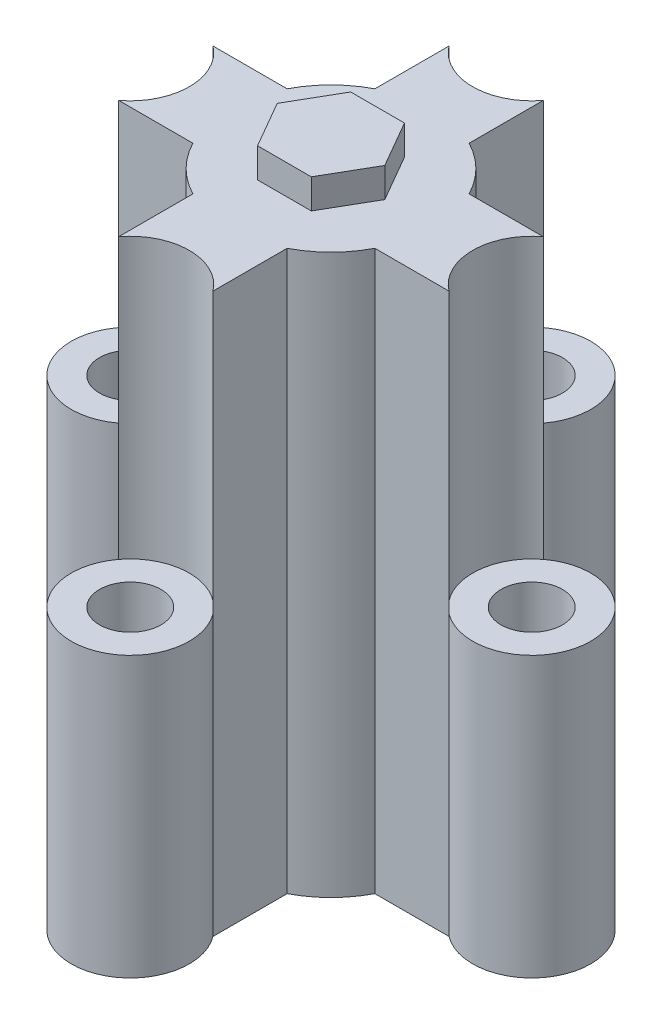
ISO-10303-21;
HEADER;
FILE_DESCRIPTION(('STEP AP214'),'2;1');
FILE_NAME('part.step','',(''),(''),'','','');
FILE_SCHEMA(('AUTOMOTIVE_DESIGN { 1 0 10303 214 1 1 1 1 }'));
ENDSEC;
DATA;
#1=APPLICATION_CONTEXT('core data for automotive mechanical design processes');
#2=APPLICATION_PROTOCOL_DEFINITION('international standard','automotive_design',2000,#1);
#3=PRODUCT_CONTEXT('',#1,'mechanical');
#4=PRODUCT('Part','Part','',(#3));
#5=PRODUCT_RELATED_PRODUCT_CATEGORY('part','',(#4));
#6=PRODUCT_DEFINITION_FORMATION('','',#4);
#7=PRODUCT_DEFINITION_CONTEXT('part definition',#1,'design');
#8=PRODUCT_DEFINITION('design','',#6,#7);
#9=PRODUCT_DEFINITION_SHAPE('','',#8);
#10=(LENGTH_UNIT() NAMED_UNIT(*) SI_UNIT(.MILLI.,.METRE.));
#11=(NAMED_UNIT(*) PLANE_ANGLE_UNIT() SI_UNIT($,.RADIAN.));
#12=(NAMED_UNIT(*) SI_UNIT($,.STERADIAN.) SOLID_ANGLE_UNIT());
#13=UNCERTAINTY_MEASURE_WITH_UNIT(LENGTH_MEASURE(1.E-05),#10,'distance_accuracy_value','');
#14=(GEOMETRIC_REPRESENTATION_CONTEXT(3) GLOBAL_UNCERTAINTY_ASSIGNED_CONTEXT((#13)) GLOBAL_UNIT_ASSIGNED_CONTEXT((#10,
#11,#12)) REPRESENTATION_CONTEXT('',''));
#15=CARTESIAN_POINT('',(0.,0.,0.));
#16=DIRECTION('',(0.,0.,1.));
#17=DIRECTION('',(1.,0.,0.));
#18=AXIS2_PLACEMENT_3D('',#15,#16,#17);
#19=CARTESIAN_POINT('',(0.,60.,-21.548));
#20=DIRECTION('',(0.,-1.,0.));
#21=DIRECTION('',(0.,0.,-1.));
#22=AXIS2_PLACEMENT_3D('',#19,#20,#21);
#23=CYLINDRICAL_SURFACE('',#22,6.33899999999994);
#24=CARTESIAN_POINT('',(0.,30.,-21.548));
#25=DIRECTION('',(0.,1.,0.));
#26=DIRECTION('',(0.,0.,1.));
#27=AXIS2_PLACEMENT_3D('',#24,#25,#26);
#28=CIRCLE('',#27,6.33899999999994);
#29=CARTESIAN_POINT('',(-5.0582994831862,30.,-17.7274598106554));
#30=VERTEX_POINT('',#29);
#31=CARTESIAN_POINT('',(5.05829948318621,30.,-17.7274598106554));
#32=VERTEX_POINT('',#31);
#33=EDGE_CURVE('E258',#30,#32,#28,.T.);
#34=ORIENTED_EDGE('',*,*,#33,.F.);
#35=DIRECTION('',(0.,-1.,0.));
#36=VECTOR('',#35,1.);
#37=CARTESIAN_POINT('',(-5.0582994831862,60.,-17.7274598106554));
#38=LINE('',#37,#36);
#39=CARTESIAN_POINT('',(-5.0582994831862,60.,-17.7274598106554));
#40=VERTEX_POINT('',#39);
#41=EDGE_CURVE('E11',#40,#30,#38,.T.);
#42=ORIENTED_EDGE('',*,*,#41,.F.);
#43=CARTESIAN_POINT('',(0.,60.,-21.548));
#44=DIRECTION('',(0.,1.,0.));
#45=DIRECTION('',(0.,0.,1.));
#46=AXIS2_PLACEMENT_3D('',#43,#44,#45);
#47=CIRCLE('',#46,6.33899999999994);
#48=CARTESIAN_POINT('',(5.05829948318621,60.,-17.7274598106554));
#49=VERTEX_POINT('',#48);
#50=EDGE_CURVE('E342',#40,#49,#47,.T.);
#51=ORIENTED_EDGE('',*,*,#50,.T.);
#52=DIRECTION('',(0.,-1.,0.));
#53=VECTOR('',#52,1.);
#54=CARTESIAN_POINT('',(5.05829948318621,60.,-17.7274598106554));
#55=LINE('',#54,#53);
#56=EDGE_CURVE('E393',#49,#32,#55,.T.);
#57=ORIENTED_EDGE('',*,*,#56,.T.);
#58=EDGE_LOOP('',(#34,#42,#51,#57));
#59=FACE_BOUND('',#58,.T.);
#60=ADVANCED_FACE('F47',(#59),#23,.F.);
#61=CARTESIAN_POINT('',(-5.05829948318621,60.,0.));
#62=DIRECTION('',(1.,0.,0.));
#63=DIRECTION('',(0.,0.,-1.));
#64=AXIS2_PLACEMENT_3D('',#61,#62,#63);
#65=PLANE('',#64);
#66=DIRECTION('',(0.,0.,1.));
#67=VECTOR('',#66,1.);
#68=CARTESIAN_POINT('',(-5.05829948318621,0.,0.));
#69=LINE('',#68,#67);
#70=CARTESIAN_POINT('',(-5.0582994831862,0.,-17.7274598106554));
#71=VERTEX_POINT('',#70);
#72=CARTESIAN_POINT('',(-5.05829948318621,0.,-9.76798885842926));
#73=VERTEX_POINT('',#72);
#74=EDGE_CURVE('E341',#71,#73,#69,.T.);
#75=ORIENTED_EDGE('',*,*,#74,.T.);
#76=DIRECTION('',(0.,-1.,0.));
#77=VECTOR('',#76,1.);
#78=CARTESIAN_POINT('',(-5.05829948318621,60.,-9.76798885842926));
#79=LINE('',#78,#77);
#80=CARTESIAN_POINT('',(-5.05829948318621,60.,-9.76798885842926));
#81=VERTEX_POINT('',#80);
#82=EDGE_CURVE('E55',#81,#73,#79,.T.);
#83=ORIENTED_EDGE('',*,*,#82,.F.);
#84=DIRECTION('',(0.,0.,1.));
#85=VECTOR('',#84,1.);
#86=CARTESIAN_POINT('',(-5.05829948318621,60.,0.));
#87=LINE('',#86,#85);
#88=EDGE_CURVE('E346',#40,#81,#87,.T.);
#89=ORIENTED_EDGE('',*,*,#88,.F.);
#90=ORIENTED_EDGE('',*,*,#41,.T.);
#91=DIRECTION('',(0.,-1.,0.));
#92=VECTOR('',#91,1.);
#93=CARTESIAN_POINT('',(-5.0582994831862,30.,-17.7274598106554));
#94=LINE('',#93,#92);
#95=EDGE_CURVE('E269',#71,#30,#94,.F.);
#96=ORIENTED_EDGE('',*,*,#95,.F.);
#97=EDGE_LOOP('',(#75,#83,#89,#90,#96));
#98=FACE_BOUND('',#97,.T.);
#99=ADVANCED_FACE('F556',(#98),#65,.F.);
#100=CARTESIAN_POINT('',(0.,60.,0.));
#101=DIRECTION('',(0.,-1.,0.));
#102=DIRECTION('',(0.,0.,-1.));
#103=AXIS2_PLACEMENT_3D('',#100,#101,#102);
#104=CYLINDRICAL_SURFACE('',#103,11.);
#105=CARTESIAN_POINT('',(0.,0.,0.));
#106=DIRECTION('',(0.,1.,0.));
#107=DIRECTION('',(0.,0.,1.));
#108=AXIS2_PLACEMENT_3D('',#105,#106,#107);
#109=CIRCLE('',#108,11.);
#110=CARTESIAN_POINT('',(-9.76798885842925,0.,-5.05829948318622));
#111=VERTEX_POINT('',#110);
#112=EDGE_CURVE('E396',#73,#111,#109,.T.);
#113=ORIENTED_EDGE('',*,*,#112,.T.);
#114=DIRECTION('',(0.,-1.,0.));
#115=VECTOR('',#114,1.);
#116=CARTESIAN_POINT('',(-9.76798885842925,60.,-5.05829948318622));
#117=LINE('',#116,#115);
#118=CARTESIAN_POINT('',(-9.76798885842925,60.,-5.05829948318622));
#119=VERTEX_POINT('',#118);
#120=EDGE_CURVE('E475',#119,#111,#117,.T.);
#121=ORIENTED_EDGE('',*,*,#120,.F.);
#122=CARTESIAN_POINT('',(0.,60.,0.));
#123=DIRECTION('',(0.,1.,0.));
#124=DIRECTION('',(0.,0.,1.));
#125=AXIS2_PLACEMENT_3D('',#122,#123,#124);
#126=CIRCLE('',#125,11.);
#127=EDGE_CURVE('E350',#81,#119,#126,.T.);
#128=ORIENTED_EDGE('',*,*,#127,.F.);
#129=ORIENTED_EDGE('',*,*,#82,.T.);
#130=EDGE_LOOP('',(#113,#121,#128,#129));
#131=FACE_BOUND('',#130,.T.);
#132=ADVANCED_FACE('F483',(#131),#104,.T.);
#133=CARTESIAN_POINT('',(0.,60.,-5.05829948318622));
#134=DIRECTION('',(0.,0.,-1.));
#135=DIRECTION('',(-1.,0.,0.));
#136=AXIS2_PLACEMENT_3D('',#133,#134,#135);
#137=PLANE('',#136);
#138=DIRECTION('',(1.,0.,0.));
#139=VECTOR('',#138,1.);
#140=CARTESIAN_POINT('',(0.,0.,-5.05829948318622));
#141=LINE('',#140,#139);
#142=CARTESIAN_POINT('',(-17.7274598106553,0.,-5.05829948318623));
#143=VERTEX_POINT('',#142);
#144=EDGE_CURVE('E400',#143,#111,#141,.T.);
#145=ORIENTED_EDGE('',*,*,#144,.F.);
#146=DIRECTION('',(0.,-1.,0.));
#147=VECTOR('',#146,1.);
#148=CARTESIAN_POINT('',(-17.7274598106553,30.,-5.05829948318623));
#149=LINE('',#148,#147);
#150=CARTESIAN_POINT('',(-17.7274598106553,30.,-5.05829948318623));
#151=VERTEX_POINT('',#150);
#152=EDGE_CURVE('E337',#143,#151,#149,.F.);
#153=ORIENTED_EDGE('',*,*,#152,.T.);
#154=DIRECTION('',(0.,-1.,0.));
#155=VECTOR('',#154,1.);
#156=CARTESIAN_POINT('',(-17.7274598106553,60.,-5.05829948318623));
#157=LINE('',#156,#155);
#158=CARTESIAN_POINT('',(-17.7274598106553,60.,-5.05829948318623));
#159=VERTEX_POINT('',#158);
#160=EDGE_CURVE('E471',#159,#151,#157,.T.);
#161=ORIENTED_EDGE('',*,*,#160,.F.);
#162=DIRECTION('',(1.,0.,0.));
#163=VECTOR('',#162,1.);
#164=CARTESIAN_POINT('',(0.,60.,-5.05829948318622));
#165=LINE('',#164,#163);
#166=EDGE_CURVE('E353',#159,#119,#165,.T.);
#167=ORIENTED_EDGE('',*,*,#166,.T.);
#168=ORIENTED_EDGE('',*,*,#120,.T.);
#169=EDGE_LOOP('',(#145,#153,#161,#167,#168));
#170=FACE_BOUND('',#169,.T.);
#171=ADVANCED_FACE('F495',(#170),#137,.T.);
#172=CARTESIAN_POINT('',(-21.548,60.,0.));
#173=DIRECTION('',(0.,-1.,0.));
#174=DIRECTION('',(0.,0.,-1.));
#175=AXIS2_PLACEMENT_3D('',#172,#173,#174);
#176=CYLINDRICAL_SURFACE('',#175,6.33899999999997);
#177=CARTESIAN_POINT('',(-21.548,30.,0.));
#178=DIRECTION('',(0.,1.,0.));
#179=DIRECTION('',(0.,0.,1.));
#180=AXIS2_PLACEMENT_3D('',#177,#178,#179);
#181=CIRCLE('',#180,6.33899999999997);
#182=CARTESIAN_POINT('',(-17.7274598106553,30.,5.05829948318619));
#183=VERTEX_POINT('',#182);
#184=EDGE_CURVE('E325',#183,#151,#181,.T.);
#185=ORIENTED_EDGE('',*,*,#184,.F.);
#186=DIRECTION('',(0.,-1.,0.));
#187=VECTOR('',#186,1.);
#188=CARTESIAN_POINT('',(-17.7274598106553,60.,5.05829948318619));
#189=LINE('',#188,#187);
#190=CARTESIAN_POINT('',(-17.7274598106553,60.,5.05829948318619));
#191=VERTEX_POINT('',#190);
#192=EDGE_CURVE('E467',#191,#183,#189,.T.);
#193=ORIENTED_EDGE('',*,*,#192,.F.);
#194=CARTESIAN_POINT('',(-21.548,60.,0.));
#195=DIRECTION('',(0.,1.,0.));
#196=DIRECTION('',(0.,0.,1.));
#197=AXIS2_PLACEMENT_3D('',#194,#195,#196);
#198=CIRCLE('',#197,6.33899999999997);
#199=EDGE_CURVE('E359',#191,#159,#198,.T.);
#200=ORIENTED_EDGE('',*,*,#199,.T.);
#201=ORIENTED_EDGE('',*,*,#160,.T.);
#202=EDGE_LOOP('',(#185,#193,#200,#201));
#203=FACE_BOUND('',#202,.T.);
#204=ADVANCED_FACE('F503',(#203),#176,.F.);
#205=CARTESIAN_POINT('',(0.,60.,5.05829948318619));
#206=DIRECTION('',(0.,0.,-1.));
#207=DIRECTION('',(-1.,0.,0.));
#208=AXIS2_PLACEMENT_3D('',#205,#206,#207);
#209=PLANE('',#208);
#210=DIRECTION('',(1.,0.,0.));
#211=VECTOR('',#210,1.);
#212=CARTESIAN_POINT('',(0.,0.,5.05829948318619));
#213=LINE('',#212,#211);
#214=CARTESIAN_POINT('',(-17.7274598106553,0.,5.0582994831862));
#215=VERTEX_POINT('',#214);
#216=CARTESIAN_POINT('',(-9.76798885842926,0.,5.05829948318619));
#217=VERTEX_POINT('',#216);
#218=EDGE_CURVE('E406',#215,#217,#213,.T.);
#219=ORIENTED_EDGE('',*,*,#218,.T.);
#220=DIRECTION('',(0.,-1.,0.));
#221=VECTOR('',#220,1.);
#222=CARTESIAN_POINT('',(-9.76798885842926,60.,5.05829948318619));
#223=LINE('',#222,#221);
#224=CARTESIAN_POINT('',(-9.76798885842926,60.,5.05829948318619));
#225=VERTEX_POINT('',#224);
#226=EDGE_CURVE('E463',#225,#217,#223,.T.);
#227=ORIENTED_EDGE('',*,*,#226,.F.);
#228=DIRECTION('',(1.,0.,0.));
#229=VECTOR('',#228,1.);
#230=CARTESIAN_POINT('',(0.,60.,5.05829948318619));
#231=LINE('',#230,#229);
#232=EDGE_CURVE('E363',#191,#225,#231,.T.);
#233=ORIENTED_EDGE('',*,*,#232,.F.);
#234=ORIENTED_EDGE('',*,*,#192,.T.);
#235=DIRECTION('',(0.,-1.,0.));
#236=VECTOR('',#235,1.);
#237=CARTESIAN_POINT('',(-17.7274598106553,30.,5.05829948318619));
#238=LINE('',#237,#236);
#239=EDGE_CURVE('E329',#215,#183,#238,.F.);
#240=ORIENTED_EDGE('',*,*,#239,.F.);
#241=EDGE_LOOP('',(#219,#227,#233,#234,#240));
#242=FACE_BOUND('',#241,.T.);
#243=ADVANCED_FACE('F508',(#242),#209,.F.);
#244=CARTESIAN_POINT('',(-5.05829948318621,0.,9.76798885842926));
#245=VERTEX_POINT('',#244);
#246=EDGE_CURVE('E402',#217,#245,#109,.T.);
#247=ORIENTED_EDGE('',*,*,#246,.T.);
#248=DIRECTION('',(0.,-1.,0.));
#249=VECTOR('',#248,1.);
#250=CARTESIAN_POINT('',(-5.05829948318621,60.,9.76798885842926));
#251=LINE('',#250,#249);
#252=CARTESIAN_POINT('',(-5.05829948318621,60.,9.76798885842926));
#253=VERTEX_POINT('',#252);
#254=EDGE_CURVE('E460',#253,#245,#251,.T.);
#255=ORIENTED_EDGE('',*,*,#254,.F.);
#256=EDGE_CURVE('E355',#225,#253,#126,.T.);
#257=ORIENTED_EDGE('',*,*,#256,.F.);
#258=ORIENTED_EDGE('',*,*,#226,.T.);
#259=EDGE_LOOP('',(#247,#255,#257,#258));
#260=FACE_BOUND('',#259,.T.);
#261=ADVANCED_FACE('F516',(#260),#104,.T.);
#262=CARTESIAN_POINT('',(-5.05829948318621,60.,0.));
#263=DIRECTION('',(-1.,0.,0.));
#264=DIRECTION('',(0.,0.,1.));
#265=AXIS2_PLACEMENT_3D('',#262,#263,#264);
#266=PLANE('',#265);
#267=DIRECTION('',(0.,0.,-1.));
#268=VECTOR('',#267,1.);
#269=CARTESIAN_POINT('',(-5.05829948318621,0.,0.));
#270=LINE('',#269,#268);
#271=CARTESIAN_POINT('',(-5.05829948318621,0.,17.7274598106553));
#272=VERTEX_POINT('',#271);
#273=EDGE_CURVE('E409',#272,#245,#270,.T.);
#274=ORIENTED_EDGE('',*,*,#273,.F.);
#275=DIRECTION('',(0.,-1.,0.));
#276=VECTOR('',#275,1.);
#277=CARTESIAN_POINT('',(-5.05829948318621,30.,17.7274598106553));
#278=LINE('',#277,#276);
#279=CARTESIAN_POINT('',(-5.0582994831862,30.,17.7274598106553));
#280=VERTEX_POINT('',#279);
#281=EDGE_CURVE('E314',#272,#280,#278,.F.);
#282=ORIENTED_EDGE('',*,*,#281,.T.);
#283=DIRECTION('',(0.,-1.,0.));
#284=VECTOR('',#283,1.);
#285=CARTESIAN_POINT('',(-5.05829948318621,60.,17.7274598106553));
#286=LINE('',#285,#284);
#287=CARTESIAN_POINT('',(-5.05829948318621,60.,17.7274598106553));
#288=VERTEX_POINT('',#287);
#289=EDGE_CURVE('E456',#288,#280,#286,.T.);
#290=ORIENTED_EDGE('',*,*,#289,.F.);
#291=DIRECTION('',(0.,0.,-1.));
#292=VECTOR('',#291,1.);
#293=CARTESIAN_POINT('',(-5.05829948318621,60.,0.));
#294=LINE('',#293,#292);
#295=EDGE_CURVE('E366',#288,#253,#294,.T.);
#296=ORIENTED_EDGE('',*,*,#295,.T.);
#297=ORIENTED_EDGE('',*,*,#254,.T.);
#298=EDGE_LOOP('',(#274,#282,#290,#296,#297));
#299=FACE_BOUND('',#298,.T.);
#300=ADVANCED_FACE('F520',(#299),#266,.T.);
#301=CARTESIAN_POINT('',(0.,60.,21.548));
#302=DIRECTION('',(0.,-1.,0.));
#303=DIRECTION('',(0.,0.,-1.));
#304=AXIS2_PLACEMENT_3D('',#301,#302,#303);
#305=CYLINDRICAL_SURFACE('',#304,6.33899999999999);
#306=CARTESIAN_POINT('',(0.,30.,21.548));
#307=DIRECTION('',(0.,1.,0.));
#308=DIRECTION('',(0.,0.,1.));
#309=AXIS2_PLACEMENT_3D('',#306,#307,#308);
#310=CIRCLE('',#309,6.33899999999999);
#311=CARTESIAN_POINT('',(5.0582994831862,30.,17.7274598106553));
#312=VERTEX_POINT('',#311);
#313=EDGE_CURVE('E302',#312,#280,#310,.T.);
#314=ORIENTED_EDGE('',*,*,#313,.F.);
#315=DIRECTION('',(0.,-1.,0.));
#316=VECTOR('',#315,1.);
#317=CARTESIAN_POINT('',(5.0582994831862,60.,17.7274598106553));
#318=LINE('',#317,#316);
#319=CARTESIAN_POINT('',(5.0582994831862,60.,17.7274598106553));
#320=VERTEX_POINT('',#319);
#321=EDGE_CURVE('E452',#320,#312,#318,.T.);
#322=ORIENTED_EDGE('',*,*,#321,.F.);
#323=CARTESIAN_POINT('',(0.,60.,21.548));
#324=DIRECTION('',(0.,1.,0.));
#325=DIRECTION('',(0.,0.,1.));
#326=AXIS2_PLACEMENT_3D('',#323,#324,#325);
#327=CIRCLE('',#326,6.33899999999999);
#328=EDGE_CURVE('E370',#320,#288,#327,.T.);
#329=ORIENTED_EDGE('',*,*,#328,.T.);
#330=ORIENTED_EDGE('',*,*,#289,.T.);
#331=EDGE_LOOP('',(#314,#322,#329,#330));
#332=FACE_BOUND('',#331,.T.);
#333=ADVANCED_FACE('F524',(#332),#305,.F.);
#334=CARTESIAN_POINT('',(5.0582994831862,60.,0.));
#335=DIRECTION('',(-1.,0.,0.));
#336=DIRECTION('',(0.,0.,1.));
#337=AXIS2_PLACEMENT_3D('',#334,#335,#336);
#338=PLANE('',#337);
#339=DIRECTION('',(0.,0.,-1.));
#340=VECTOR('',#339,1.);
#341=CARTESIAN_POINT('',(5.0582994831862,0.,0.));
#342=LINE('',#341,#340);
#343=CARTESIAN_POINT('',(5.0582994831862,0.,17.7274598106553));
#344=VERTEX_POINT('',#343);
#345=CARTESIAN_POINT('',(5.0582994831862,0.,9.76798885842926));
#346=VERTEX_POINT('',#345);
#347=EDGE_CURVE('E413',#344,#346,#342,.T.);
#348=ORIENTED_EDGE('',*,*,#347,.T.);
#349=DIRECTION('',(0.,-1.,0.));
#350=VECTOR('',#349,1.);
#351=CARTESIAN_POINT('',(5.0582994831862,60.,9.76798885842926));
#352=LINE('',#351,#350);
#353=CARTESIAN_POINT('',(5.0582994831862,60.,9.76798885842926));
#354=VERTEX_POINT('',#353);
#355=EDGE_CURVE('E448',#354,#346,#352,.T.);
#356=ORIENTED_EDGE('',*,*,#355,.F.);
#357=DIRECTION('',(0.,0.,-1.));
#358=VECTOR('',#357,1.);
#359=CARTESIAN_POINT('',(5.0582994831862,60.,0.));
#360=LINE('',#359,#358);
#361=EDGE_CURVE('E374',#320,#354,#360,.T.);
#362=ORIENTED_EDGE('',*,*,#361,.F.);
#363=ORIENTED_EDGE('',*,*,#321,.T.);
#364=DIRECTION('',(0.,-1.,0.));
#365=VECTOR('',#364,1.);
#366=CARTESIAN_POINT('',(5.0582994831862,30.,17.7274598106553));
#367=LINE('',#366,#365);
#368=EDGE_CURVE('E306',#344,#312,#367,.F.);
#369=ORIENTED_EDGE('',*,*,#368,.F.);
#370=EDGE_LOOP('',(#348,#356,#362,#363,#369));
#371=FACE_BOUND('',#370,.T.);
#372=ADVANCED_FACE('F531',(#371),#338,.F.);
#373=CARTESIAN_POINT('',(9.76798885842926,0.,5.0582994831862));
#374=VERTEX_POINT('',#373);
#375=EDGE_CURVE('E416',#346,#374,#109,.T.);
#376=ORIENTED_EDGE('',*,*,#375,.T.);
#377=DIRECTION('',(0.,-1.,0.));
#378=VECTOR('',#377,1.);
#379=CARTESIAN_POINT('',(9.76798885842926,60.,5.0582994831862));
#380=LINE('',#379,#378);
#381=CARTESIAN_POINT('',(9.76798885842926,60.,5.0582994831862));
#382=VERTEX_POINT('',#381);
#383=EDGE_CURVE('E445',#382,#374,#380,.T.);
#384=ORIENTED_EDGE('',*,*,#383,.F.);
#385=EDGE_CURVE('E377',#354,#382,#126,.T.);
#386=ORIENTED_EDGE('',*,*,#385,.F.);
#387=ORIENTED_EDGE('',*,*,#355,.T.);
#388=EDGE_LOOP('',(#376,#384,#386,#387));
#389=FACE_BOUND('',#388,.T.);
#390=ADVANCED_FACE('F537',(#389),#104,.T.);
#391=CARTESIAN_POINT('',(0.,60.,5.0582994831862));
#392=DIRECTION('',(0.,0.,1.));
#393=DIRECTION('',(1.,0.,0.));
#394=AXIS2_PLACEMENT_3D('',#391,#392,#393);
#395=PLANE('',#394);
#396=DIRECTION('',(-1.,0.,0.));
#397=VECTOR('',#396,1.);
#398=CARTESIAN_POINT('',(0.,0.,5.0582994831862));
#399=LINE('',#398,#397);
#400=CARTESIAN_POINT('',(17.7274598106553,0.,5.05829948318621));
#401=VERTEX_POINT('',#400);
#402=EDGE_CURVE('E417',#401,#374,#399,.T.);
#403=ORIENTED_EDGE('',*,*,#402,.F.);
#404=DIRECTION('',(0.,-1.,0.));
#405=VECTOR('',#404,1.);
#406=CARTESIAN_POINT('',(17.7274598106553,30.,5.05829948318621));
#407=LINE('',#406,#405);
#408=CARTESIAN_POINT('',(17.7274598106553,30.,5.05829948318621));
#409=VERTEX_POINT('',#408);
#410=EDGE_CURVE('E291',#401,#409,#407,.F.);
#411=ORIENTED_EDGE('',*,*,#410,.T.);
#412=DIRECTION('',(0.,-1.,0.));
#413=VECTOR('',#412,1.);
#414=CARTESIAN_POINT('',(17.7274598106553,60.,5.05829948318621));
#415=LINE('',#414,#413);
#416=CARTESIAN_POINT('',(17.7274598106553,60.,5.05829948318621));
#417=VERTEX_POINT('',#416);
#418=EDGE_CURVE('E441',#417,#409,#415,.T.);
#419=ORIENTED_EDGE('',*,*,#418,.F.);
#420=DIRECTION('',(-1.,0.,0.));
#421=VECTOR('',#420,1.);
#422=CARTESIAN_POINT('',(0.,60.,5.0582994831862));
#423=LINE('',#422,#421);
#424=EDGE_CURVE('E378',#417,#382,#423,.T.);
#425=ORIENTED_EDGE('',*,*,#424,.T.);
#426=ORIENTED_EDGE('',*,*,#383,.T.);
#427=EDGE_LOOP('',(#403,#411,#419,#425,#426));
#428=FACE_BOUND('',#427,.T.);
#429=ADVANCED_FACE('F577',(#428),#395,.T.);
#430=CARTESIAN_POINT('',(21.548,60.,0.));
#431=DIRECTION('',(0.,-1.,0.));
#432=DIRECTION('',(0.,0.,-1.));
#433=AXIS2_PLACEMENT_3D('',#430,#431,#432);
#434=CYLINDRICAL_SURFACE('',#433,6.339);
#435=CARTESIAN_POINT('',(21.548,30.,0.));
#436=DIRECTION('',(0.,1.,0.));
#437=DIRECTION('',(0.,0.,1.));
#438=AXIS2_PLACEMENT_3D('',#435,#436,#437);
#439=CIRCLE('',#438,6.339);
#440=CARTESIAN_POINT('',(17.7274598106553,30.,-5.05829948318621));
#441=VERTEX_POINT('',#440);
#442=EDGE_CURVE('E279',#441,#409,#439,.T.);
#443=ORIENTED_EDGE('',*,*,#442,.F.);
#444=DIRECTION('',(0.,-1.,0.));
#445=VECTOR('',#444,1.);
#446=CARTESIAN_POINT('',(17.7274598106553,60.,-5.05829948318621));
#447=LINE('',#446,#445);
#448=CARTESIAN_POINT('',(17.7274598106553,60.,-5.05829948318621));
#449=VERTEX_POINT('',#448);
#450=EDGE_CURVE('E437',#449,#441,#447,.T.);
#451=ORIENTED_EDGE('',*,*,#450,.F.);
#452=CARTESIAN_POINT('',(21.548,60.,0.));
#453=DIRECTION('',(0.,1.,0.));
#454=DIRECTION('',(0.,0.,1.));
#455=AXIS2_PLACEMENT_3D('',#452,#453,#454);
#456=CIRCLE('',#455,6.339);
#457=EDGE_CURVE('E382',#449,#417,#456,.T.);
#458=ORIENTED_EDGE('',*,*,#457,.T.);
#459=ORIENTED_EDGE('',*,*,#418,.T.);
#460=EDGE_LOOP('',(#443,#451,#458,#459));
#461=FACE_BOUND('',#460,.T.);
#462=ADVANCED_FACE('F580',(#461),#434,.F.);
#463=CARTESIAN_POINT('',(0.,60.,-5.05829948318621));
#464=DIRECTION('',(0.,0.,1.));
#465=DIRECTION('',(1.,0.,0.));
#466=AXIS2_PLACEMENT_3D('',#463,#464,#465);
#467=PLANE('',#466);
#468=DIRECTION('',(-1.,0.,0.));
#469=VECTOR('',#468,1.);
#470=CARTESIAN_POINT('',(0.,0.,-5.05829948318621));
#471=LINE('',#470,#469);
#472=CARTESIAN_POINT('',(17.7274598106553,0.,-5.05829948318621));
#473=VERTEX_POINT('',#472);
#474=CARTESIAN_POINT('',(9.76798885842926,0.,-5.05829948318621));
#475=VERTEX_POINT('',#474);
#476=EDGE_CURVE('E421',#473,#475,#471,.T.);
#477=ORIENTED_EDGE('',*,*,#476,.T.);
#478=DIRECTION('',(0.,-1.,0.));
#479=VECTOR('',#478,1.);
#480=CARTESIAN_POINT('',(9.76798885842926,60.,-5.05829948318621));
#481=LINE('',#480,#479);
#482=CARTESIAN_POINT('',(9.76798885842926,60.,-5.05829948318621));
#483=VERTEX_POINT('',#482);
#484=EDGE_CURVE('E433',#483,#475,#481,.T.);
#485=ORIENTED_EDGE('',*,*,#484,.F.);
#486=DIRECTION('',(-1.,0.,0.));
#487=VECTOR('',#486,1.);
#488=CARTESIAN_POINT('',(0.,60.,-5.05829948318621));
#489=LINE('',#488,#487);
#490=EDGE_CURVE('E386',#449,#483,#489,.T.);
#491=ORIENTED_EDGE('',*,*,#490,.F.);
#492=ORIENTED_EDGE('',*,*,#450,.T.);
#493=DIRECTION('',(0.,-1.,0.));
#494=VECTOR('',#493,1.);
#495=CARTESIAN_POINT('',(17.7274598106553,30.,-5.05829948318621));
#496=LINE('',#495,#494);
#497=EDGE_CURVE('E283',#473,#441,#496,.F.);
#498=ORIENTED_EDGE('',*,*,#497,.F.);
#499=EDGE_LOOP('',(#477,#485,#491,#492,#498));
#500=FACE_BOUND('',#499,.T.);
#501=ADVANCED_FACE('F583',(#500),#467,.F.);
#502=CARTESIAN_POINT('',(5.05829948318622,0.,-9.76798885842925));
#503=VERTEX_POINT('',#502);
#504=EDGE_CURVE('E401',#475,#503,#109,.T.);
#505=ORIENTED_EDGE('',*,*,#504,.T.);
#506=DIRECTION('',(0.,-1.,0.));
#507=VECTOR('',#506,1.);
#508=CARTESIAN_POINT('',(5.05829948318622,60.,-9.76798885842925));
#509=LINE('',#508,#507);
#510=CARTESIAN_POINT('',(5.05829948318622,60.,-9.76798885842925));
#511=VERTEX_POINT('',#510);
#512=EDGE_CURVE('E430',#511,#503,#509,.T.);
#513=ORIENTED_EDGE('',*,*,#512,.F.);
#514=EDGE_CURVE('E354',#483,#511,#126,.T.);
#515=ORIENTED_EDGE('',*,*,#514,.F.);
#516=ORIENTED_EDGE('',*,*,#484,.T.);
#517=EDGE_LOOP('',(#505,#513,#515,#516));
#518=FACE_BOUND('',#517,.T.);
#519=ADVANCED_FACE('F548',(#518),#104,.T.);
#520=CARTESIAN_POINT('',(5.05829948318622,60.,0.));
#521=DIRECTION('',(1.,0.,0.));
#522=DIRECTION('',(0.,0.,-1.));
#523=AXIS2_PLACEMENT_3D('',#520,#521,#522);
#524=PLANE('',#523);
#525=DIRECTION('',(0.,0.,1.));
#526=VECTOR('',#525,1.);
#527=CARTESIAN_POINT('',(5.05829948318622,0.,0.));
#528=LINE('',#527,#526);
#529=CARTESIAN_POINT('',(5.05829948318621,0.,-17.7274598106554));
#530=VERTEX_POINT('',#529);
#531=EDGE_CURVE('E347',#530,#503,#528,.T.);
#532=ORIENTED_EDGE('',*,*,#531,.F.);
#533=DIRECTION('',(0.,-1.,0.));
#534=VECTOR('',#533,1.);
#535=CARTESIAN_POINT('',(5.05829948318621,30.,-17.7274598106554));
#536=LINE('',#535,#534);
#537=EDGE_CURVE('E262',#530,#32,#536,.F.);
#538=ORIENTED_EDGE('',*,*,#537,.T.);
#539=ORIENTED_EDGE('',*,*,#56,.F.);
#540=DIRECTION('',(0.,0.,1.));
#541=VECTOR('',#540,1.);
#542=CARTESIAN_POINT('',(5.05829948318622,60.,0.));
#543=LINE('',#542,#541);
#544=EDGE_CURVE('E389',#49,#511,#543,.T.);
#545=ORIENTED_EDGE('',*,*,#544,.T.);
#546=ORIENTED_EDGE('',*,*,#512,.T.);
#547=EDGE_LOOP('',(#532,#538,#539,#545,#546));
#548=FACE_BOUND('',#547,.T.);
#549=ADVANCED_FACE('F552',(#548),#524,.T.);
#550=CARTESIAN_POINT('',(0.,60.,0.));
#551=DIRECTION('',(0.,1.,0.));
#552=DIRECTION('',(0.,0.,1.));
#553=AXIS2_PLACEMENT_3D('',#550,#551,#552);
#554=PLANE('',#553);
#555=DIRECTION('',(0.5,0.,-0.866025403784439));
#556=VECTOR('',#555,1.);
#557=CARTESIAN_POINT('',(2.88675134594813,60.,5.));
#558=LINE('',#557,#556);
#559=CARTESIAN_POINT('',(2.88675134594813,60.,5.));
#560=VERTEX_POINT('',#559);
#561=CARTESIAN_POINT('',(5.77350269189626,60.,0.));
#562=VERTEX_POINT('',#561);
#563=EDGE_CURVE('E62',#560,#562,#558,.T.);
#564=ORIENTED_EDGE('',*,*,#563,.F.);
#565=DIRECTION('',(1.,0.,0.));
#566=VECTOR('',#565,1.);
#567=CARTESIAN_POINT('',(-2.88675134594813,60.,5.));
#568=LINE('',#567,#566);
#569=CARTESIAN_POINT('',(-2.88675134594813,60.,5.));
#570=VERTEX_POINT('',#569);
#571=EDGE_CURVE('E66',#570,#560,#568,.T.);
#572=ORIENTED_EDGE('',*,*,#571,.F.);
#573=DIRECTION('',(0.5,0.,0.866025403784438));
#574=VECTOR('',#573,1.);
#575=CARTESIAN_POINT('',(-5.77350269189626,60.,0.));
#576=LINE('',#575,#574);
#577=CARTESIAN_POINT('',(-5.77350269189626,60.,0.));
#578=VERTEX_POINT('',#577);
#579=EDGE_CURVE('E953',#578,#570,#576,.T.);
#580=ORIENTED_EDGE('',*,*,#579,.F.);
#581=DIRECTION('',(-0.5,0.,0.866025403784439));
#582=VECTOR('',#581,1.);
#583=CARTESIAN_POINT('',(-2.88675134594813,60.,-5.));
#584=LINE('',#583,#582);
#585=CARTESIAN_POINT('',(-2.88675134594813,60.,-5.));
#586=VERTEX_POINT('',#585);
#587=EDGE_CURVE('E973',#586,#578,#584,.T.);
#588=ORIENTED_EDGE('',*,*,#587,.F.);
#589=DIRECTION('',(-1.,0.,0.));
#590=VECTOR('',#589,1.);
#591=CARTESIAN_POINT('',(2.88675134594813,60.,-5.00000000000001));
#592=LINE('',#591,#590);
#593=CARTESIAN_POINT('',(2.88675134594813,60.,-5.00000000000001));
#594=VERTEX_POINT('',#593);
#595=EDGE_CURVE('E976',#594,#586,#592,.T.);
#596=ORIENTED_EDGE('',*,*,#595,.F.);
#597=DIRECTION('',(-0.5,0.,-0.866025403784439));
#598=VECTOR('',#597,1.);
#599=CARTESIAN_POINT('',(5.77350269189626,60.,0.));
#600=LINE('',#599,#598);
#601=EDGE_CURVE('E978',#562,#594,#600,.T.);
#602=ORIENTED_EDGE('',*,*,#601,.F.);
#603=EDGE_LOOP('',(#564,#572,#580,#588,#596,#602));
#604=FACE_BOUND('',#603,.T.);
#605=ORIENTED_EDGE('',*,*,#50,.F.);
#606=ORIENTED_EDGE('',*,*,#88,.T.);
#607=ORIENTED_EDGE('',*,*,#127,.T.);
#608=ORIENTED_EDGE('',*,*,#166,.F.);
#609=ORIENTED_EDGE('',*,*,#199,.F.);
#610=ORIENTED_EDGE('',*,*,#232,.T.);
#611=ORIENTED_EDGE('',*,*,#256,.T.);
#612=ORIENTED_EDGE('',*,*,#295,.F.);
#613=ORIENTED_EDGE('',*,*,#328,.F.);
#614=ORIENTED_EDGE('',*,*,#361,.T.);
#615=ORIENTED_EDGE('',*,*,#385,.T.);
#616=ORIENTED_EDGE('',*,*,#424,.F.);
#617=ORIENTED_EDGE('',*,*,#457,.F.);
#618=ORIENTED_EDGE('',*,*,#490,.T.);
#619=ORIENTED_EDGE('',*,*,#514,.T.);
#620=ORIENTED_EDGE('',*,*,#544,.F.);
#621=EDGE_LOOP('',(#605,#606,#607,#608,#609,#610,#611,#612,#613,#614,#615,#616,#617,#618,#619,#620));
#622=FACE_BOUND('',#621,.T.);
#623=ADVANCED_FACE('F500',(#604,#622),#554,.T.);
#624=CARTESIAN_POINT('',(0.,0.,0.));
#625=DIRECTION('',(0.,1.,0.));
#626=DIRECTION('',(0.,0.,1.));
#627=AXIS2_PLACEMENT_3D('',#624,#625,#626);
#628=PLANE('',#627);
#629=ORIENTED_EDGE('',*,*,#74,.F.);
#630=CARTESIAN_POINT('',(0.,0.,-21.548));
#631=DIRECTION('',(0.,1.,0.));
#632=DIRECTION('',(0.,0.,1.));
#633=AXIS2_PLACEMENT_3D('',#630,#631,#632);
#634=CIRCLE('',#633,6.33899999999994);
#635=EDGE_CURVE('E248',#530,#71,#634,.T.);
#636=ORIENTED_EDGE('',*,*,#635,.F.);
#637=ORIENTED_EDGE('',*,*,#531,.T.);
#638=ORIENTED_EDGE('',*,*,#504,.F.);
#639=ORIENTED_EDGE('',*,*,#476,.F.);
#640=CARTESIAN_POINT('',(21.548,0.,0.));
#641=DIRECTION('',(0.,1.,0.));
#642=DIRECTION('',(0.,0.,1.));
#643=AXIS2_PLACEMENT_3D('',#640,#641,#642);
#644=CIRCLE('',#643,6.339);
#645=EDGE_CURVE('E278',#401,#473,#644,.T.);
#646=ORIENTED_EDGE('',*,*,#645,.F.);
#647=ORIENTED_EDGE('',*,*,#402,.T.);
#648=ORIENTED_EDGE('',*,*,#375,.F.);
#649=ORIENTED_EDGE('',*,*,#347,.F.);
#650=CARTESIAN_POINT('',(0.,0.,21.548));
#651=DIRECTION('',(0.,1.,0.));
#652=DIRECTION('',(0.,0.,1.));
#653=AXIS2_PLACEMENT_3D('',#650,#651,#652);
#654=CIRCLE('',#653,6.33899999999999);
#655=EDGE_CURVE('E301',#272,#344,#654,.T.);
#656=ORIENTED_EDGE('',*,*,#655,.F.);
#657=ORIENTED_EDGE('',*,*,#273,.T.);
#658=ORIENTED_EDGE('',*,*,#246,.F.);
#659=ORIENTED_EDGE('',*,*,#218,.F.);
#660=CARTESIAN_POINT('',(-21.548,0.,0.));
#661=DIRECTION('',(0.,1.,0.));
#662=DIRECTION('',(0.,0.,1.));
#663=AXIS2_PLACEMENT_3D('',#660,#661,#662);
#664=CIRCLE('',#663,6.33899999999997);
#665=EDGE_CURVE('E324',#143,#215,#664,.T.);
#666=ORIENTED_EDGE('',*,*,#665,.F.);
#667=ORIENTED_EDGE('',*,*,#144,.T.);
#668=ORIENTED_EDGE('',*,*,#112,.F.);
#669=EDGE_LOOP('',(#629,#636,#637,#638,#639,#646,#647,#648,#649,#656,#657,#658,#659,#666,#667,#668));
#670=FACE_BOUND('',#669,.T.);
#671=CARTESIAN_POINT('',(-21.548,0.,-1.50468879778784E-13));
#672=DIRECTION('',(0.,1.,0.));
#673=DIRECTION('',(0.,0.,1.));
#674=AXIS2_PLACEMENT_3D('',#671,#672,#673);
#675=CIRCLE('',#674,3.302);
#676=CARTESIAN_POINT('',(-21.548,0.,3.30199999999985));
#677=VERTEX_POINT('',#676);
#678=EDGE_CURVE('E318',#677,#677,#675,.T.);
#679=ORIENTED_EDGE('',*,*,#678,.T.);
#680=EDGE_LOOP('',(#679));
#681=FACE_BOUND('',#680,.T.);
#682=CARTESIAN_POINT('',(0.,0.,21.548));
#683=DIRECTION('',(0.,1.,0.));
#684=DIRECTION('',(0.,0.,1.));
#685=AXIS2_PLACEMENT_3D('',#682,#683,#684);
#686=CIRCLE('',#685,3.302);
#687=CARTESIAN_POINT('',(0.,0.,24.85));
#688=VERTEX_POINT('',#687);
#689=EDGE_CURVE('E295',#688,#688,#686,.T.);
#690=ORIENTED_EDGE('',*,*,#689,.T.);
#691=EDGE_LOOP('',(#690));
#692=FACE_BOUND('',#691,.T.);
#693=CARTESIAN_POINT('',(21.548,0.,0.));
#694=DIRECTION('',(0.,1.,0.));
#695=DIRECTION('',(0.,0.,1.));
#696=AXIS2_PLACEMENT_3D('',#693,#694,#695);
#697=CIRCLE('',#696,3.302);
#698=CARTESIAN_POINT('',(21.548,0.,3.302));
#699=VERTEX_POINT('',#698);
#700=EDGE_CURVE('E272',#699,#699,#697,.T.);
#701=ORIENTED_EDGE('',*,*,#700,.T.);
#702=EDGE_LOOP('',(#701));
#703=FACE_BOUND('',#702,.T.);
#704=CARTESIAN_POINT('',(2.25703319668175E-13,0.,-21.548));
#705=DIRECTION('',(0.,1.,0.));
#706=DIRECTION('',(0.,0.,1.));
#707=AXIS2_PLACEMENT_3D('',#704,#705,#706);
#708=CIRCLE('',#707,3.302);
#709=CARTESIAN_POINT('',(2.25703319668175E-13,0.,-18.246));
#710=VERTEX_POINT('',#709);
#711=EDGE_CURVE('E243',#710,#710,#708,.T.);
#712=ORIENTED_EDGE('',*,*,#711,.T.);
#713=EDGE_LOOP('',(#712));
#714=FACE_BOUND('',#713,.T.);
#715=ADVANCED_FACE('F489',(#670,#681,#692,#703,#714),#628,.F.);
#716=CARTESIAN_POINT('',(-21.548,30.,-1.50468879778784E-13));
#717=DIRECTION('',(0.,-1.,0.));
#718=DIRECTION('',(0.,0.,-1.));
#719=AXIS2_PLACEMENT_3D('',#716,#717,#718);
#720=CYLINDRICAL_SURFACE('',#719,3.302);
#721=CARTESIAN_POINT('',(-21.548,30.,-1.50468879778784E-13));
#722=DIRECTION('',(0.,1.,0.));
#723=DIRECTION('',(0.,0.,1.));
#724=AXIS2_PLACEMENT_3D('',#721,#722,#723);
#725=CIRCLE('',#724,3.302);
#726=CARTESIAN_POINT('',(-21.548,30.,3.30199999999985));
#727=VERTEX_POINT('',#726);
#728=EDGE_CURVE('E319',#727,#727,#725,.T.);
#729=ORIENTED_EDGE('',*,*,#728,.T.);
#730=EDGE_LOOP('',(#729));
#731=FACE_BOUND('',#730,.T.);
#732=ORIENTED_EDGE('',*,*,#678,.F.);
#733=EDGE_LOOP('',(#732));
#734=FACE_BOUND('',#733,.T.);
#735=ADVANCED_FACE('F633',(#731,#734),#720,.F.);
#736=CARTESIAN_POINT('',(-21.548,30.,0.));
#737=DIRECTION('',(0.,-1.,0.));
#738=DIRECTION('',(0.,0.,-1.));
#739=AXIS2_PLACEMENT_3D('',#736,#737,#738);
#740=CYLINDRICAL_SURFACE('',#739,6.33899999999997);
#741=ORIENTED_EDGE('',*,*,#152,.F.);
#742=ORIENTED_EDGE('',*,*,#665,.T.);
#743=ORIENTED_EDGE('',*,*,#239,.T.);
#744=EDGE_CURVE('E323',#151,#183,#181,.T.);
#745=ORIENTED_EDGE('',*,*,#744,.F.);
#746=EDGE_LOOP('',(#741,#742,#743,#745));
#747=FACE_BOUND('',#746,.T.);
#748=ADVANCED_FACE('F638',(#747),#740,.T.);
#749=CARTESIAN_POINT('',(0.,30.,0.));
#750=DIRECTION('',(0.,1.,0.));
#751=DIRECTION('',(0.,0.,1.));
#752=AXIS2_PLACEMENT_3D('',#749,#750,#751);
#753=PLANE('',#752);
#754=ORIENTED_EDGE('',*,*,#728,.F.);
#755=EDGE_LOOP('',(#754));
#756=FACE_BOUND('',#755,.T.);
#757=ORIENTED_EDGE('',*,*,#184,.T.);
#758=ORIENTED_EDGE('',*,*,#744,.T.);
#759=EDGE_LOOP('',(#757,#758));
#760=FACE_BOUND('',#759,.T.);
#761=ADVANCED_FACE('F642',(#756,#760),#753,.T.);
#762=CARTESIAN_POINT('',(0.,30.,21.548));
#763=DIRECTION('',(0.,-1.,0.));
#764=DIRECTION('',(0.,0.,-1.));
#765=AXIS2_PLACEMENT_3D('',#762,#763,#764);
#766=CYLINDRICAL_SURFACE('',#765,3.302);
#767=CARTESIAN_POINT('',(0.,30.,21.548));
#768=DIRECTION('',(0.,1.,0.));
#769=DIRECTION('',(0.,0.,1.));
#770=AXIS2_PLACEMENT_3D('',#767,#768,#769);
#771=CIRCLE('',#770,3.302);
#772=CARTESIAN_POINT('',(0.,30.,24.85));
#773=VERTEX_POINT('',#772);
#774=EDGE_CURVE('E296',#773,#773,#771,.T.);
#775=ORIENTED_EDGE('',*,*,#774,.T.);
#776=EDGE_LOOP('',(#775));
#777=FACE_BOUND('',#776,.T.);
#778=ORIENTED_EDGE('',*,*,#689,.F.);
#779=EDGE_LOOP('',(#778));
#780=FACE_BOUND('',#779,.T.);
#781=ADVANCED_FACE('F646',(#777,#780),#766,.F.);
#782=CARTESIAN_POINT('',(0.,30.,21.548));
#783=DIRECTION('',(0.,-1.,0.));
#784=DIRECTION('',(0.,0.,-1.));
#785=AXIS2_PLACEMENT_3D('',#782,#783,#784);
#786=CYLINDRICAL_SURFACE('',#785,6.33899999999999);
#787=ORIENTED_EDGE('',*,*,#281,.F.);
#788=ORIENTED_EDGE('',*,*,#655,.T.);
#789=ORIENTED_EDGE('',*,*,#368,.T.);
#790=EDGE_CURVE('E300',#280,#312,#310,.T.);
#791=ORIENTED_EDGE('',*,*,#790,.F.);
#792=EDGE_LOOP('',(#787,#788,#789,#791));
#793=FACE_BOUND('',#792,.T.);
#794=ADVANCED_FACE('F650',(#793),#786,.T.);
#795=CARTESIAN_POINT('',(0.,30.,0.));
#796=DIRECTION('',(0.,1.,0.));
#797=DIRECTION('',(0.,0.,1.));
#798=AXIS2_PLACEMENT_3D('',#795,#796,#797);
#799=PLANE('',#798);
#800=ORIENTED_EDGE('',*,*,#774,.F.);
#801=EDGE_LOOP('',(#800));
#802=FACE_BOUND('',#801,.T.);
#803=ORIENTED_EDGE('',*,*,#313,.T.);
#804=ORIENTED_EDGE('',*,*,#790,.T.);
#805=EDGE_LOOP('',(#803,#804));
#806=FACE_BOUND('',#805,.T.);
#807=ADVANCED_FACE('F654',(#802,#806),#799,.T.);
#808=CARTESIAN_POINT('',(21.548,30.,0.));
#809=DIRECTION('',(0.,-1.,0.));
#810=DIRECTION('',(0.,0.,-1.));
#811=AXIS2_PLACEMENT_3D('',#808,#809,#810);
#812=CYLINDRICAL_SURFACE('',#811,3.302);
#813=CARTESIAN_POINT('',(21.548,30.,0.));
#814=DIRECTION('',(0.,1.,0.));
#815=DIRECTION('',(0.,0.,1.));
#816=AXIS2_PLACEMENT_3D('',#813,#814,#815);
#817=CIRCLE('',#816,3.302);
#818=CARTESIAN_POINT('',(21.548,30.,3.302));
#819=VERTEX_POINT('',#818);
#820=EDGE_CURVE('E273',#819,#819,#817,.T.);
#821=ORIENTED_EDGE('',*,*,#820,.T.);
#822=EDGE_LOOP('',(#821));
#823=FACE_BOUND('',#822,.T.);
#824=ORIENTED_EDGE('',*,*,#700,.F.);
#825=EDGE_LOOP('',(#824));
#826=FACE_BOUND('',#825,.T.);
#827=ADVANCED_FACE('F597',(#823,#826),#812,.F.);
#828=CARTESIAN_POINT('',(21.548,30.,0.));
#829=DIRECTION('',(0.,-1.,0.));
#830=DIRECTION('',(0.,0.,-1.));
#831=AXIS2_PLACEMENT_3D('',#828,#829,#830);
#832=CYLINDRICAL_SURFACE('',#831,6.339);
#833=ORIENTED_EDGE('',*,*,#410,.F.);
#834=ORIENTED_EDGE('',*,*,#645,.T.);
#835=ORIENTED_EDGE('',*,*,#497,.T.);
#836=EDGE_CURVE('E277',#409,#441,#439,.T.);
#837=ORIENTED_EDGE('',*,*,#836,.F.);
#838=EDGE_LOOP('',(#833,#834,#835,#837));
#839=FACE_BOUND('',#838,.T.);
#840=ADVANCED_FACE('F585',(#839),#832,.T.);
#841=CARTESIAN_POINT('',(0.,30.,0.));
#842=DIRECTION('',(0.,1.,0.));
#843=DIRECTION('',(0.,0.,1.));
#844=AXIS2_PLACEMENT_3D('',#841,#842,#843);
#845=PLANE('',#844);
#846=ORIENTED_EDGE('',*,*,#820,.F.);
#847=EDGE_LOOP('',(#846));
#848=FACE_BOUND('',#847,.T.);
#849=ORIENTED_EDGE('',*,*,#442,.T.);
#850=ORIENTED_EDGE('',*,*,#836,.T.);
#851=EDGE_LOOP('',(#849,#850));
#852=FACE_BOUND('',#851,.T.);
#853=ADVANCED_FACE('F587',(#848,#852),#845,.T.);
#854=CARTESIAN_POINT('',(0.,30.,-21.548));
#855=DIRECTION('',(0.,-1.,0.));
#856=DIRECTION('',(0.,0.,-1.));
#857=AXIS2_PLACEMENT_3D('',#854,#855,#856);
#858=CYLINDRICAL_SURFACE('',#857,6.33899999999994);
#859=ORIENTED_EDGE('',*,*,#635,.T.);
#860=ORIENTED_EDGE('',*,*,#95,.T.);
#861=EDGE_CURVE('E259',#32,#30,#28,.T.);
#862=ORIENTED_EDGE('',*,*,#861,.F.);
#863=ORIENTED_EDGE('',*,*,#537,.F.);
#864=EDGE_LOOP('',(#859,#860,#862,#863));
#865=FACE_BOUND('',#864,.T.);
#866=ADVANCED_FACE('F560',(#865),#858,.T.);
#867=CARTESIAN_POINT('',(2.25703319668175E-13,30.,-21.548));
#868=DIRECTION('',(0.,-1.,0.));
#869=DIRECTION('',(0.,0.,-1.));
#870=AXIS2_PLACEMENT_3D('',#867,#868,#869);
#871=CYLINDRICAL_SURFACE('',#870,3.302);
#872=CARTESIAN_POINT('',(2.25703319668175E-13,30.,-21.548));
#873=DIRECTION('',(0.,1.,0.));
#874=DIRECTION('',(0.,0.,1.));
#875=AXIS2_PLACEMENT_3D('',#872,#873,#874);
#876=CIRCLE('',#875,3.302);
#877=CARTESIAN_POINT('',(2.25703319668175E-13,30.,-18.246));
#878=VERTEX_POINT('',#877);
#879=EDGE_CURVE('E254',#878,#878,#876,.T.);
#880=ORIENTED_EDGE('',*,*,#879,.T.);
#881=EDGE_LOOP('',(#880));
#882=FACE_BOUND('',#881,.T.);
#883=ORIENTED_EDGE('',*,*,#711,.F.);
#884=EDGE_LOOP('',(#883));
#885=FACE_BOUND('',#884,.T.);
#886=ADVANCED_FACE('F595',(#882,#885),#871,.F.);
#887=CARTESIAN_POINT('',(0.,30.,0.));
#888=DIRECTION('',(0.,1.,0.));
#889=DIRECTION('',(0.,0.,1.));
#890=AXIS2_PLACEMENT_3D('',#887,#888,#889);
#891=PLANE('',#890);
#892=ORIENTED_EDGE('',*,*,#879,.F.);
#893=EDGE_LOOP('',(#892));
#894=FACE_BOUND('',#893,.T.);
#895=ORIENTED_EDGE('',*,*,#861,.T.);
#896=ORIENTED_EDGE('',*,*,#33,.T.);
#897=EDGE_LOOP('',(#895,#896));
#898=FACE_BOUND('',#897,.T.);
#899=ADVANCED_FACE('F562',(#894,#898),#891,.T.);
#900=CARTESIAN_POINT('',(2.88675134594813,63.175,5.));
#901=DIRECTION('',(-0.866025403784439,0.,-0.5));
#902=DIRECTION('',(-0.5,0.,0.866025403784439));
#903=AXIS2_PLACEMENT_3D('',#900,#901,#902);
#904=PLANE('',#903);
#905=ORIENTED_EDGE('',*,*,#563,.T.);
#906=DIRECTION('',(0.,-1.,0.));
#907=VECTOR('',#906,1.);
#908=CARTESIAN_POINT('',(5.77350269189626,63.175,0.));
#909=LINE('',#908,#907);
#910=CARTESIAN_POINT('',(5.77350269189626,63.175,0.));
#911=VERTEX_POINT('',#910);
#912=EDGE_CURVE('E223',#911,#562,#909,.T.);
#913=ORIENTED_EDGE('',*,*,#912,.F.);
#914=DIRECTION('',(0.5,0.,-0.866025403784439));
#915=VECTOR('',#914,1.);
#916=CARTESIAN_POINT('',(2.88675134594813,63.175,5.));
#917=LINE('',#916,#915);
#918=CARTESIAN_POINT('',(2.88675134594813,63.175,5.));
#919=VERTEX_POINT('',#918);
#920=EDGE_CURVE('E230',#919,#911,#917,.T.);
#921=ORIENTED_EDGE('',*,*,#920,.F.);
#922=DIRECTION('',(0.,-1.,0.));
#923=VECTOR('',#922,1.);
#924=CARTESIAN_POINT('',(2.88675134594813,63.175,5.));
#925=LINE('',#924,#923);
#926=EDGE_CURVE('E949',#919,#560,#925,.T.);
#927=ORIENTED_EDGE('',*,*,#926,.T.);
#928=EDGE_LOOP('',(#905,#913,#921,#927));
#929=FACE_BOUND('',#928,.T.);
#930=ADVANCED_FACE('F241',(#929),#904,.F.);
#931=CARTESIAN_POINT('',(5.77350269189626,63.175,0.));
#932=DIRECTION('',(-0.866025403784439,0.,0.5));
#933=DIRECTION('',(0.5,0.,0.866025403784439));
#934=AXIS2_PLACEMENT_3D('',#931,#932,#933);
#935=PLANE('',#934);
#936=ORIENTED_EDGE('',*,*,#601,.T.);
#937=DIRECTION('',(0.,-1.,0.));
#938=VECTOR('',#937,1.);
#939=CARTESIAN_POINT('',(2.88675134594813,63.175,-5.00000000000001));
#940=LINE('',#939,#938);
#941=CARTESIAN_POINT('',(2.88675134594813,63.175,-5.00000000000001));
#942=VERTEX_POINT('',#941);
#943=EDGE_CURVE('E225',#942,#594,#940,.T.);
#944=ORIENTED_EDGE('',*,*,#943,.F.);
#945=DIRECTION('',(-0.5,0.,-0.866025403784439));
#946=VECTOR('',#945,1.);
#947=CARTESIAN_POINT('',(5.77350269189626,63.175,0.));
#948=LINE('',#947,#946);
#949=EDGE_CURVE('E218',#911,#942,#948,.T.);
#950=ORIENTED_EDGE('',*,*,#949,.F.);
#951=ORIENTED_EDGE('',*,*,#912,.T.);
#952=EDGE_LOOP('',(#936,#944,#950,#951));
#953=FACE_BOUND('',#952,.T.);
#954=ADVANCED_FACE('F221',(#953),#935,.F.);
#955=CARTESIAN_POINT('',(2.88675134594813,63.175,-5.00000000000001));
#956=DIRECTION('',(0.,0.,1.));
#957=DIRECTION('',(1.,0.,0.));
#958=AXIS2_PLACEMENT_3D('',#955,#956,#957);
#959=PLANE('',#958);
#960=ORIENTED_EDGE('',*,*,#595,.T.);
#961=DIRECTION('',(0.,-1.,0.));
#962=VECTOR('',#961,1.);
#963=CARTESIAN_POINT('',(-2.88675134594813,63.175,-5.));
#964=LINE('',#963,#962);
#965=CARTESIAN_POINT('',(-2.88675134594813,63.175,-5.));
#966=VERTEX_POINT('',#965);
#967=EDGE_CURVE('E250',#966,#586,#964,.T.);
#968=ORIENTED_EDGE('',*,*,#967,.F.);
#969=DIRECTION('',(-1.,0.,0.));
#970=VECTOR('',#969,1.);
#971=CARTESIAN_POINT('',(2.88675134594813,63.175,-5.00000000000001));
#972=LINE('',#971,#970);
#973=EDGE_CURVE('E229',#942,#966,#972,.T.);
#974=ORIENTED_EDGE('',*,*,#973,.F.);
#975=ORIENTED_EDGE('',*,*,#943,.T.);
#976=EDGE_LOOP('',(#960,#968,#974,#975));
#977=FACE_BOUND('',#976,.T.);
#978=ADVANCED_FACE('F681',(#977),#959,.F.);
#979=CARTESIAN_POINT('',(-2.88675134594813,63.175,-5.));
#980=DIRECTION('',(0.866025403784439,0.,0.5));
#981=DIRECTION('',(0.5,0.,-0.866025403784439));
#982=AXIS2_PLACEMENT_3D('',#979,#980,#981);
#983=PLANE('',#982);
#984=ORIENTED_EDGE('',*,*,#587,.T.);
#985=DIRECTION('',(0.,-1.,0.));
#986=VECTOR('',#985,1.);
#987=CARTESIAN_POINT('',(-5.77350269189626,63.175,0.));
#988=LINE('',#987,#986);
#989=CARTESIAN_POINT('',(-5.77350269189626,63.175,0.));
#990=VERTEX_POINT('',#989);
#991=EDGE_CURVE('E959',#990,#578,#988,.T.);
#992=ORIENTED_EDGE('',*,*,#991,.F.);
#993=DIRECTION('',(-0.5,0.,0.866025403784439));
#994=VECTOR('',#993,1.);
#995=CARTESIAN_POINT('',(-2.88675134594813,63.175,-5.));
#996=LINE('',#995,#994);
#997=EDGE_CURVE('E974',#966,#990,#996,.T.);
#998=ORIENTED_EDGE('',*,*,#997,.F.);
#999=ORIENTED_EDGE('',*,*,#967,.T.);
#1000=EDGE_LOOP('',(#984,#992,#998,#999));
#1001=FACE_BOUND('',#1000,.T.);
#1002=ADVANCED_FACE('F684',(#1001),#983,.F.);
#1003=CARTESIAN_POINT('',(-5.77350269189626,63.175,0.));
#1004=DIRECTION('',(0.866025403784439,0.,-0.5));
#1005=DIRECTION('',(-0.5,0.,-0.866025403784439));
#1006=AXIS2_PLACEMENT_3D('',#1003,#1004,#1005);
#1007=PLANE('',#1006);
#1008=ORIENTED_EDGE('',*,*,#579,.T.);
#1009=DIRECTION('',(0.,-1.,0.));
#1010=VECTOR('',#1009,1.);
#1011=CARTESIAN_POINT('',(-2.88675134594813,63.175,5.));
#1012=LINE('',#1011,#1010);
#1013=CARTESIAN_POINT('',(-2.88675134594813,63.175,5.));
#1014=VERTEX_POINT('',#1013);
#1015=EDGE_CURVE('E951',#1014,#570,#1012,.T.);
#1016=ORIENTED_EDGE('',*,*,#1015,.F.);
#1017=DIRECTION('',(0.5,0.,0.866025403784438));
#1018=VECTOR('',#1017,1.);
#1019=CARTESIAN_POINT('',(-5.77350269189626,63.175,0.));
#1020=LINE('',#1019,#1018);
#1021=EDGE_CURVE('E961',#990,#1014,#1020,.T.);
#1022=ORIENTED_EDGE('',*,*,#1021,.F.);
#1023=ORIENTED_EDGE('',*,*,#991,.T.);
#1024=EDGE_LOOP('',(#1008,#1016,#1022,#1023));
#1025=FACE_BOUND('',#1024,.T.);
#1026=ADVANCED_FACE('F688',(#1025),#1007,.F.);
#1027=CARTESIAN_POINT('',(-2.88675134594813,63.175,5.));
#1028=DIRECTION('',(0.,0.,-1.));
#1029=DIRECTION('',(-1.,0.,0.));
#1030=AXIS2_PLACEMENT_3D('',#1027,#1028,#1029);
#1031=PLANE('',#1030);
#1032=ORIENTED_EDGE('',*,*,#571,.T.);
#1033=ORIENTED_EDGE('',*,*,#926,.F.);
#1034=DIRECTION('',(1.,0.,0.));
#1035=VECTOR('',#1034,1.);
#1036=CARTESIAN_POINT('',(-2.88675134594813,63.175,5.));
#1037=LINE('',#1036,#1035);
#1038=EDGE_CURVE('E235',#1014,#919,#1037,.T.);
#1039=ORIENTED_EDGE('',*,*,#1038,.F.);
#1040=ORIENTED_EDGE('',*,*,#1015,.T.);
#1041=EDGE_LOOP('',(#1032,#1033,#1039,#1040));
#1042=FACE_BOUND('',#1041,.T.);
#1043=ADVANCED_FACE('F692',(#1042),#1031,.F.);
#1044=CARTESIAN_POINT('',(0.,63.175,0.));
#1045=DIRECTION('',(0.,1.,0.));
#1046=DIRECTION('',(0.,0.,1.));
#1047=AXIS2_PLACEMENT_3D('',#1044,#1045,#1046);
#1048=PLANE('',#1047);
#1049=ORIENTED_EDGE('',*,*,#920,.T.);
#1050=ORIENTED_EDGE('',*,*,#949,.T.);
#1051=ORIENTED_EDGE('',*,*,#973,.T.);
#1052=ORIENTED_EDGE('',*,*,#997,.T.);
#1053=ORIENTED_EDGE('',*,*,#1021,.T.);
#1054=ORIENTED_EDGE('',*,*,#1038,.T.);
#1055=EDGE_LOOP('',(#1049,#1050,#1051,#1052,#1053,#1054));
#1056=FACE_BOUND('',#1055,.T.);
#1057=ADVANCED_FACE('F233',(#1056),#1048,.T.);
#1058=CLOSED_SHELL('',(#60,#99,#132,#171,#204,#243,#261,#300,#333,#372,#390,#429,#462,#501,#519,
#549,#623,#715,#735,#748,#761,#781,#794,#807,#827,#840,#853,#866,#886,#899,#930,#954,#978,#1002,
#1026,#1043,#1057));
#1059=MANIFOLD_SOLID_BREP('B2',#1058);
#1060=ADVANCED_BREP_SHAPE_REPRESENTATION('',(#18,#1059),#14);
#1061=SHAPE_DEFINITION_REPRESENTATION(#9,#1060);
ENDSEC;
END-ISO-10303-21;
